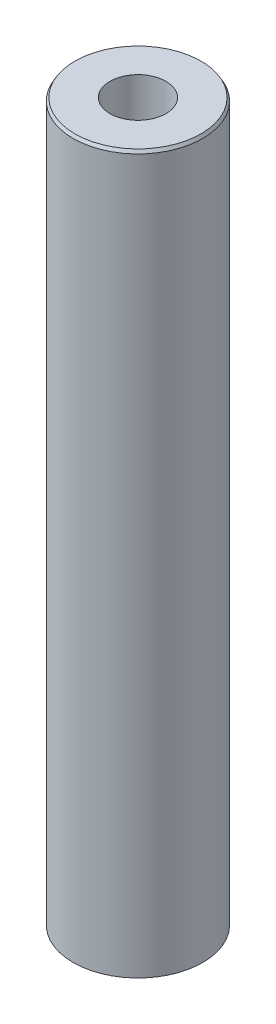
ISO-10303-21;
HEADER;
FILE_DESCRIPTION(('STEP AP214'),'2;1');
FILE_NAME('part.step','',(''),(''),'','','');
FILE_SCHEMA(('AUTOMOTIVE_DESIGN { 1 0 10303 214 1 1 1 1 }'));
ENDSEC;
DATA;
#1=APPLICATION_CONTEXT('core data for automotive mechanical design processes');
#2=APPLICATION_PROTOCOL_DEFINITION('international standard','automotive_design',2000,#1);
#3=PRODUCT_CONTEXT('',#1,'mechanical');
#4=PRODUCT('Part','Part','',(#3));
#5=PRODUCT_RELATED_PRODUCT_CATEGORY('part','',(#4));
#6=PRODUCT_DEFINITION_FORMATION('','',#4);
#7=PRODUCT_DEFINITION_CONTEXT('part definition',#1,'design');
#8=PRODUCT_DEFINITION('design','',#6,#7);
#9=PRODUCT_DEFINITION_SHAPE('','',#8);
#10=(LENGTH_UNIT() NAMED_UNIT(*) SI_UNIT(.MILLI.,.METRE.));
#11=(NAMED_UNIT(*) PLANE_ANGLE_UNIT() SI_UNIT($,.RADIAN.));
#12=(NAMED_UNIT(*) SI_UNIT($,.STERADIAN.) SOLID_ANGLE_UNIT());
#13=UNCERTAINTY_MEASURE_WITH_UNIT(LENGTH_MEASURE(1.E-05),#10,'distance_accuracy_value','');
#14=(GEOMETRIC_REPRESENTATION_CONTEXT(3) GLOBAL_UNCERTAINTY_ASSIGNED_CONTEXT((#13)) GLOBAL_UNIT_ASSIGNED_CONTEXT((#10,
#11,#12)) REPRESENTATION_CONTEXT('',''));
#15=CARTESIAN_POINT('',(0.,0.,0.));
#16=DIRECTION('',(0.,0.,1.));
#17=DIRECTION('',(1.,0.,0.));
#18=AXIS2_PLACEMENT_3D('',#15,#16,#17);
#19=CARTESIAN_POINT('',(0.,554.214912450644,0.));
#20=DIRECTION('',(0.,-1.,0.));
#21=DIRECTION('',(0.,0.,-1.));
#22=AXIS2_PLACEMENT_3D('',#19,#20,#21);
#23=CYLINDRICAL_SURFACE('',#22,50.);
#24=CARTESIAN_POINT('',(0.,551.827846821978,0.));
#25=DIRECTION('',(0.,1.,0.));
#26=DIRECTION('',(0.,0.,1.));
#27=AXIS2_PLACEMENT_3D('',#24,#25,#26);
#28=CIRCLE('',#27,50.);
#29=CARTESIAN_POINT('',(0.,551.827846821978,50.));
#30=VERTEX_POINT('',#29);
#31=EDGE_CURVE('E50',#30,#30,#28,.F.);
#32=ORIENTED_EDGE('',*,*,#31,.T.);
#33=EDGE_LOOP('',(#32));
#34=FACE_BOUND('',#33,.T.);
#35=CARTESIAN_POINT('',(0.,1.37817298328324,0.));
#36=DIRECTION('',(0.,1.,0.));
#37=DIRECTION('',(0.,0.,1.));
#38=AXIS2_PLACEMENT_3D('',#35,#36,#37);
#39=CIRCLE('',#38,50.);
#40=CARTESIAN_POINT('',(0.,1.37817298328324,50.));
#41=VERTEX_POINT('',#40);
#42=EDGE_CURVE('E51',#41,#41,#39,.T.);
#43=ORIENTED_EDGE('',*,*,#42,.T.);
#44=EDGE_LOOP('',(#43));
#45=FACE_BOUND('',#44,.T.);
#46=ADVANCED_FACE('F39',(#34,#45),#23,.T.);
#47=CARTESIAN_POINT('',(0.,554.214912450644,0.));
#48=DIRECTION('',(0.,1.,0.));
#49=DIRECTION('',(0.,0.,1.));
#50=AXIS2_PLACEMENT_3D('',#47,#48,#49);
#51=PLANE('',#50);
#52=CARTESIAN_POINT('',(0.,554.214912450644,0.));
#53=DIRECTION('',(0.,1.,0.));
#54=DIRECTION('',(0.,0.,1.));
#55=AXIS2_PLACEMENT_3D('',#52,#53,#54);
#56=CIRCLE('',#55,48.6218270167165);
#57=CARTESIAN_POINT('',(0.,554.214912450644,48.6218270167165));
#58=VERTEX_POINT('',#57);
#59=EDGE_CURVE('E54',#58,#58,#56,.T.);
#60=ORIENTED_EDGE('',*,*,#59,.T.);
#61=EDGE_LOOP('',(#60));
#62=FACE_BOUND('',#61,.T.);
#63=CARTESIAN_POINT('',(0.,554.214912450644,0.));
#64=DIRECTION('',(0.,1.,0.));
#65=DIRECTION('',(0.,0.,1.));
#66=AXIS2_PLACEMENT_3D('',#63,#64,#65);
#67=CIRCLE('',#66,21.6040749608928);
#68=CARTESIAN_POINT('',(0.,554.214912450644,21.6040749608928));
#69=VERTEX_POINT('',#68);
#70=EDGE_CURVE('E58',#69,#69,#67,.T.);
#71=ORIENTED_EDGE('',*,*,#70,.F.);
#72=EDGE_LOOP('',(#71));
#73=FACE_BOUND('',#72,.T.);
#74=ADVANCED_FACE('F69',(#62,#73),#51,.T.);
#75=CARTESIAN_POINT('',(0.,0.,0.));
#76=DIRECTION('',(0.,1.,0.));
#77=DIRECTION('',(0.,0.,1.));
#78=AXIS2_PLACEMENT_3D('',#75,#76,#77);
#79=PLANE('',#78);
#80=CARTESIAN_POINT('',(0.,0.,0.));
#81=DIRECTION('',(0.,1.,0.));
#82=DIRECTION('',(0.,0.,1.));
#83=AXIS2_PLACEMENT_3D('',#80,#81,#82);
#84=CIRCLE('',#83,47.6129343713346);
#85=CARTESIAN_POINT('',(0.,0.,47.6129343713346));
#86=VERTEX_POINT('',#85);
#87=EDGE_CURVE('E10',#86,#86,#84,.F.);
#88=ORIENTED_EDGE('',*,*,#87,.T.);
#89=EDGE_LOOP('',(#88));
#90=FACE_BOUND('',#89,.T.);
#91=CARTESIAN_POINT('',(0.,0.,0.));
#92=DIRECTION('',(0.,1.,0.));
#93=DIRECTION('',(0.,0.,1.));
#94=AXIS2_PLACEMENT_3D('',#91,#92,#93);
#95=CIRCLE('',#94,21.6040749608928);
#96=CARTESIAN_POINT('',(0.,0.,21.6040749608928));
#97=VERTEX_POINT('',#96);
#98=EDGE_CURVE('E63',#97,#97,#95,.T.);
#99=ORIENTED_EDGE('',*,*,#98,.T.);
#100=EDGE_LOOP('',(#99));
#101=FACE_BOUND('',#100,.T.);
#102=ADVANCED_FACE('F75',(#90,#101),#79,.F.);
#103=CARTESIAN_POINT('',(0.,554.214912450644,0.));
#104=DIRECTION('',(0.,-1.,0.));
#105=DIRECTION('',(0.,0.,-1.));
#106=AXIS2_PLACEMENT_3D('',#103,#104,#105);
#107=CYLINDRICAL_SURFACE('',#106,21.6040749608928);
#108=ORIENTED_EDGE('',*,*,#70,.T.);
#109=EDGE_LOOP('',(#108));
#110=FACE_BOUND('',#109,.T.);
#111=ORIENTED_EDGE('',*,*,#98,.F.);
#112=EDGE_LOOP('',(#111));
#113=FACE_BOUND('',#112,.T.);
#114=ADVANCED_FACE('F70',(#110,#113),#107,.F.);
#115=CARTESIAN_POINT('',(0.,554.214912450644,0.));
#116=DIRECTION('',(0.,-1.,0.));
#117=DIRECTION('',(0.,0.,-1.));
#118=AXIS2_PLACEMENT_3D('',#115,#116,#117);
#119=CONICAL_SURFACE('',#118,48.6218270167165,0.5235987755983);
#120=ORIENTED_EDGE('',*,*,#31,.F.);
#121=EDGE_LOOP('',(#120));
#122=FACE_BOUND('',#121,.T.);
#123=ORIENTED_EDGE('',*,*,#59,.F.);
#124=EDGE_LOOP('',(#123));
#125=FACE_BOUND('',#124,.T.);
#126=ADVANCED_FACE('F81',(#122,#125),#119,.T.);
#127=CARTESIAN_POINT('',(0.,1.37817298328324,0.));
#128=DIRECTION('',(0.,1.,0.));
#129=DIRECTION('',(0.,0.,1.));
#130=AXIS2_PLACEMENT_3D('',#127,#128,#129);
#131=CONICAL_SURFACE('',#130,50.,1.04719755119661);
#132=ORIENTED_EDGE('',*,*,#87,.F.);
#133=EDGE_LOOP('',(#132));
#134=FACE_BOUND('',#133,.T.);
#135=ORIENTED_EDGE('',*,*,#42,.F.);
#136=EDGE_LOOP('',(#135));
#137=FACE_BOUND('',#136,.T.);
#138=ADVANCED_FACE('F45',(#134,#137),#131,.T.);
#139=CLOSED_SHELL('',(#46,#74,#102,#114,#126,#138));
#140=MANIFOLD_SOLID_BREP('B2',#139);
#141=ADVANCED_BREP_SHAPE_REPRESENTATION('',(#18,#140),#14);
#142=SHAPE_DEFINITION_REPRESENTATION(#9,#141);
ENDSEC;
END-ISO-10303-21;
